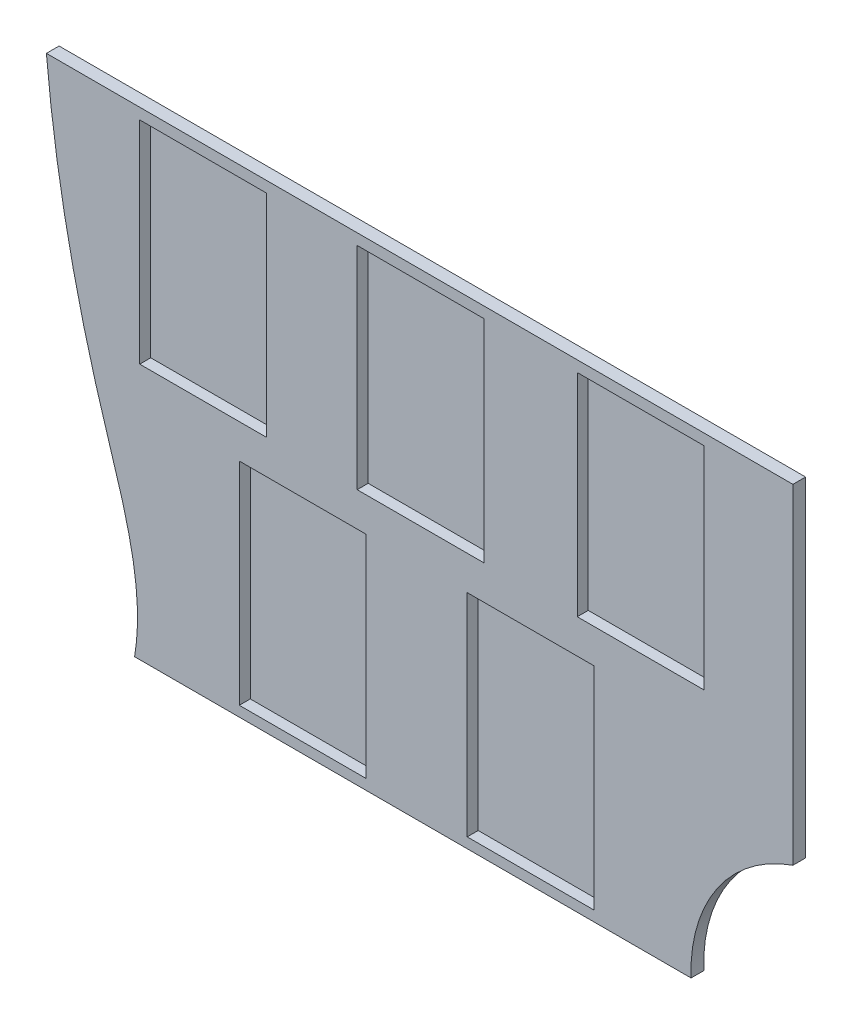
ISO-10303-21;
HEADER;
FILE_DESCRIPTION(('STEP AP214'),'2;1');
FILE_NAME('part.step','',(''),(''),'','','');
FILE_SCHEMA(('AUTOMOTIVE_DESIGN { 1 0 10303 214 1 1 1 1 }'));
ENDSEC;
DATA;
#1=APPLICATION_CONTEXT('core data for automotive mechanical design processes');
#2=APPLICATION_PROTOCOL_DEFINITION('international standard','automotive_design',2000,#1);
#3=PRODUCT_CONTEXT('',#1,'mechanical');
#4=PRODUCT('Part','Part','',(#3));
#5=PRODUCT_RELATED_PRODUCT_CATEGORY('part','',(#4));
#6=PRODUCT_DEFINITION_FORMATION('','',#4);
#7=PRODUCT_DEFINITION_CONTEXT('part definition',#1,'design');
#8=PRODUCT_DEFINITION('design','',#6,#7);
#9=PRODUCT_DEFINITION_SHAPE('','',#8);
#10=(LENGTH_UNIT() NAMED_UNIT(*) SI_UNIT(.MILLI.,.METRE.));
#11=(NAMED_UNIT(*) PLANE_ANGLE_UNIT() SI_UNIT($,.RADIAN.));
#12=(NAMED_UNIT(*) SI_UNIT($,.STERADIAN.) SOLID_ANGLE_UNIT());
#13=UNCERTAINTY_MEASURE_WITH_UNIT(LENGTH_MEASURE(1.E-05),#10,'distance_accuracy_value','');
#14=(GEOMETRIC_REPRESENTATION_CONTEXT(3) GLOBAL_UNCERTAINTY_ASSIGNED_CONTEXT((#13)) GLOBAL_UNIT_ASSIGNED_CONTEXT((#10,
#11,#12)) REPRESENTATION_CONTEXT('',''));
#15=CARTESIAN_POINT('',(0.,0.,0.));
#16=DIRECTION('',(0.,0.,1.));
#17=DIRECTION('',(1.,0.,0.));
#18=AXIS2_PLACEMENT_3D('',#15,#16,#17);
#19=CARTESIAN_POINT('',(-10.924558286228,76.07506,1.5));
#20=CARTESIAN_POINT('',(-11.3352160372191,65.7010516205482,1.5));
#21=CARTESIAN_POINT('',(-10.1348838021836,47.6104937241192,1.5));
#22=CARTESIAN_POINT('',(-4.20479563086311,22.5706008825194,1.5));
#23=CARTESIAN_POINT('',(1.32459293414909,7.94260350650526,1.5));
#24=CARTESIAN_POINT('',(0.,0.,1.5));
#25=B_SPLINE_CURVE_WITH_KNOTS('',3,(#19,#20,#21,#22,#23,#24),.UNSPECIFIED.,.F.,.F.,(4,1,1,4),
(0.,0.403327980613903,0.698479283031292,1.),.UNSPECIFIED.);
#26=DIRECTION('',(0.,0.,-1.));
#27=VECTOR('',#26,1.);
#28=SURFACE_OF_LINEAR_EXTRUSION('',#25,#27);
#29=CARTESIAN_POINT('',(-10.4260949755614,56.55,1.5));
#30=VERTEX_POINT('',#29);
#31=CARTESIAN_POINT('',(0.,0.,1.5));
#32=VERTEX_POINT('',#31);
#33=EDGE_CURVE('E376',#30,#32,#25,.T.);
#34=ORIENTED_EDGE('',*,*,#33,.F.);
#35=DIRECTION('',(0.,0.,-1.));
#36=VECTOR('',#35,1.);
#37=CARTESIAN_POINT('',(-10.4260949755614,56.55,1.5));
#38=LINE('',#37,#36);
#39=CARTESIAN_POINT('',(-10.4260949755614,56.55,0.));
#40=VERTEX_POINT('',#39);
#41=EDGE_CURVE('E370',#30,#40,#38,.T.);
#42=ORIENTED_EDGE('',*,*,#41,.T.);
#43=CARTESIAN_POINT('',(-10.924558286228,76.07506,0.));
#44=CARTESIAN_POINT('',(-11.3352160372191,65.7010516205482,0.));
#45=CARTESIAN_POINT('',(-10.1348838021836,47.6104937241192,0.));
#46=CARTESIAN_POINT('',(-4.20479563086311,22.5706008825194,0.));
#47=CARTESIAN_POINT('',(1.32459293414909,7.94260350650526,0.));
#48=CARTESIAN_POINT('',(0.,0.,0.));
#49=B_SPLINE_CURVE_WITH_KNOTS('',3,(#43,#44,#45,#46,#47,#48),.UNSPECIFIED.,.F.,.F.,(4,1,1,4),
(0.,0.403327980613903,0.698479283031292,1.),.UNSPECIFIED.);
#50=CARTESIAN_POINT('',(0.,0.,0.));
#51=VERTEX_POINT('',#50);
#52=EDGE_CURVE('E375',#40,#51,#49,.T.);
#53=ORIENTED_EDGE('',*,*,#52,.T.);
#54=DIRECTION('',(0.,0.,-1.));
#55=VECTOR('',#54,1.);
#56=CARTESIAN_POINT('',(0.,0.,1.5));
#57=LINE('',#56,#55);
#58=EDGE_CURVE('E43',#32,#51,#57,.T.);
#59=ORIENTED_EDGE('',*,*,#58,.F.);
#60=EDGE_LOOP('',(#34,#42,#53,#59));
#61=FACE_BOUND('',#60,.T.);
#62=ADVANCED_FACE('F35',(#61),#28,.F.);
#63=CARTESIAN_POINT('',(0.,0.,1.5));
#64=DIRECTION('',(0.,1.,0.));
#65=DIRECTION('',(0.,0.,1.));
#66=AXIS2_PLACEMENT_3D('',#63,#64,#65);
#67=PLANE('',#66);
#68=DIRECTION('',(1.,0.,0.));
#69=VECTOR('',#68,1.);
#70=CARTESIAN_POINT('',(0.,0.,0.));
#71=LINE('',#70,#69);
#72=CARTESIAN_POINT('',(65.76731,0.,0.));
#73=VERTEX_POINT('',#72);
#74=EDGE_CURVE('E396',#51,#73,#71,.T.);
#75=ORIENTED_EDGE('',*,*,#74,.T.);
#76=DIRECTION('',(0.,0.,-1.));
#77=VECTOR('',#76,1.);
#78=CARTESIAN_POINT('',(65.76731,0.,1.5));
#79=LINE('',#78,#77);
#80=CARTESIAN_POINT('',(65.76731,0.,1.5));
#81=VERTEX_POINT('',#80);
#82=EDGE_CURVE('E407',#81,#73,#79,.T.);
#83=ORIENTED_EDGE('',*,*,#82,.F.);
#84=DIRECTION('',(1.,0.,0.));
#85=VECTOR('',#84,1.);
#86=CARTESIAN_POINT('',(0.,0.,1.5));
#87=LINE('',#86,#85);
#88=EDGE_CURVE('E381',#32,#81,#87,.T.);
#89=ORIENTED_EDGE('',*,*,#88,.F.);
#90=ORIENTED_EDGE('',*,*,#58,.T.);
#91=EDGE_LOOP('',(#75,#83,#89,#90));
#92=FACE_BOUND('',#91,.T.);
#93=ADVANCED_FACE('F413',(#92),#67,.F.);
#94=CARTESIAN_POINT('',(83.6444405634415,0.646040445844383,1.5));
#95=DIRECTION('',(0.,0.,-1.));
#96=DIRECTION('',(-1.,0.,0.));
#97=AXIS2_PLACEMENT_3D('',#94,#95,#96);
#98=CYLINDRICAL_SURFACE('',#97,17.8888);
#99=CARTESIAN_POINT('',(83.6444405634415,0.646040445844383,0.));
#100=DIRECTION('',(0.,0.,-1.));
#101=DIRECTION('',(-1.,0.,0.));
#102=AXIS2_PLACEMENT_3D('',#99,#100,#101);
#103=CIRCLE('',#102,17.8888);
#104=CARTESIAN_POINT('',(77.804111713772,17.55461,0.));
#105=VERTEX_POINT('',#104);
#106=EDGE_CURVE('E401',#73,#105,#103,.T.);
#107=ORIENTED_EDGE('',*,*,#106,.T.);
#108=DIRECTION('',(0.,0.,-1.));
#109=VECTOR('',#108,1.);
#110=CARTESIAN_POINT('',(77.804111713772,17.55461,1.5));
#111=LINE('',#110,#109);
#112=CARTESIAN_POINT('',(77.804111713772,17.55461,1.5));
#113=VERTEX_POINT('',#112);
#114=EDGE_CURVE('E392',#113,#105,#111,.T.);
#115=ORIENTED_EDGE('',*,*,#114,.F.);
#116=CARTESIAN_POINT('',(83.6444405634415,0.646040445844383,1.5));
#117=DIRECTION('',(0.,0.,-1.));
#118=DIRECTION('',(-1.,0.,0.));
#119=AXIS2_PLACEMENT_3D('',#116,#117,#118);
#120=CIRCLE('',#119,17.8888);
#121=EDGE_CURVE('E387',#81,#113,#120,.T.);
#122=ORIENTED_EDGE('',*,*,#121,.F.);
#123=ORIENTED_EDGE('',*,*,#82,.T.);
#124=EDGE_LOOP('',(#107,#115,#122,#123));
#125=FACE_BOUND('',#124,.T.);
#126=ADVANCED_FACE('F426',(#125),#98,.F.);
#127=CARTESIAN_POINT('',(77.804111713772,17.55461,1.5));
#128=DIRECTION('',(-1.,0.,0.));
#129=DIRECTION('',(0.,-1.,0.));
#130=AXIS2_PLACEMENT_3D('',#127,#128,#129);
#131=PLANE('',#130);
#132=DIRECTION('',(0.,1.,0.));
#133=VECTOR('',#132,1.);
#134=CARTESIAN_POINT('',(77.804111713772,17.55461,0.));
#135=LINE('',#134,#133);
#136=CARTESIAN_POINT('',(77.804111713772,56.55,0.));
#137=VERTEX_POINT('',#136);
#138=EDGE_CURVE('E382',#105,#137,#135,.T.);
#139=ORIENTED_EDGE('',*,*,#138,.T.);
#140=DIRECTION('',(0.,0.,1.));
#141=VECTOR('',#140,1.);
#142=CARTESIAN_POINT('',(77.804111713772,56.55,1.5));
#143=LINE('',#142,#141);
#144=CARTESIAN_POINT('',(77.804111713772,56.55,1.5));
#145=VERTEX_POINT('',#144);
#146=EDGE_CURVE('E361',#137,#145,#143,.T.);
#147=ORIENTED_EDGE('',*,*,#146,.T.);
#148=DIRECTION('',(0.,1.,0.));
#149=VECTOR('',#148,1.);
#150=CARTESIAN_POINT('',(77.804111713772,17.55461,1.5));
#151=LINE('',#150,#149);
#152=EDGE_CURVE('E389',#113,#145,#151,.T.);
#153=ORIENTED_EDGE('',*,*,#152,.F.);
#154=ORIENTED_EDGE('',*,*,#114,.T.);
#155=EDGE_LOOP('',(#139,#147,#153,#154));
#156=FACE_BOUND('',#155,.T.);
#157=ADVANCED_FACE('F430',(#156),#131,.F.);
#158=CARTESIAN_POINT('',(-7.59671426617067,37.675096173794,1.5));
#159=DIRECTION('',(0.,0.,-1.));
#160=DIRECTION('',(-1.,0.,0.));
#161=AXIS2_PLACEMENT_3D('',#158,#159,#160);
#162=PLANE('',#161);
#163=DIRECTION('',(1.,0.,0.));
#164=VECTOR('',#163,1.);
#165=CARTESIAN_POINT('',(39.3104482923767,1.21758236796934,1.5));
#166=LINE('',#165,#164);
#167=CARTESIAN_POINT('',(39.3104482923767,1.21758236796934,1.5));
#168=VERTEX_POINT('',#167);
#169=CARTESIAN_POINT('',(54.3104482923767,1.21758236796934,1.5));
#170=VERTEX_POINT('',#169);
#171=EDGE_CURVE('E322',#168,#170,#166,.T.);
#172=ORIENTED_EDGE('',*,*,#171,.F.);
#173=DIRECTION('',(0.,-1.,0.));
#174=VECTOR('',#173,1.);
#175=CARTESIAN_POINT('',(39.3104482923767,26.2175823679693,1.5));
#176=LINE('',#175,#174);
#177=CARTESIAN_POINT('',(39.3104482923767,26.2175823679693,1.5));
#178=VERTEX_POINT('',#177);
#179=EDGE_CURVE('E50',#178,#168,#176,.T.);
#180=ORIENTED_EDGE('',*,*,#179,.F.);
#181=DIRECTION('',(-1.,0.,0.));
#182=VECTOR('',#181,1.);
#183=CARTESIAN_POINT('',(39.3104482923767,26.2175823679693,1.5));
#184=LINE('',#183,#182);
#185=CARTESIAN_POINT('',(54.3104482923767,26.2175823679693,1.5));
#186=VERTEX_POINT('',#185);
#187=EDGE_CURVE('E311',#186,#178,#184,.T.);
#188=ORIENTED_EDGE('',*,*,#187,.F.);
#189=DIRECTION('',(0.,1.,0.));
#190=VECTOR('',#189,1.);
#191=CARTESIAN_POINT('',(54.3104482923767,26.2175823679693,1.5));
#192=LINE('',#191,#190);
#193=EDGE_CURVE('E325',#170,#186,#192,.T.);
#194=ORIENTED_EDGE('',*,*,#193,.F.);
#195=EDGE_LOOP('',(#172,#180,#188,#194));
#196=FACE_BOUND('',#195,.T.);
#197=DIRECTION('',(1.,0.,0.));
#198=VECTOR('',#197,1.);
#199=CARTESIAN_POINT('',(12.3712803912311,1.21758236796934,1.5));
#200=LINE('',#199,#198);
#201=CARTESIAN_POINT('',(12.3712803912311,1.21758236796934,1.5));
#202=VERTEX_POINT('',#201);
#203=CARTESIAN_POINT('',(27.3712803912311,1.21758236796934,1.5));
#204=VERTEX_POINT('',#203);
#205=EDGE_CURVE('E292',#202,#204,#200,.T.);
#206=ORIENTED_EDGE('',*,*,#205,.F.);
#207=DIRECTION('',(0.,-1.,0.));
#208=VECTOR('',#207,1.);
#209=CARTESIAN_POINT('',(12.3712803912311,26.2175823679693,1.5));
#210=LINE('',#209,#208);
#211=CARTESIAN_POINT('',(12.3712803912311,26.2175823679693,1.5));
#212=VERTEX_POINT('',#211);
#213=EDGE_CURVE('E58',#212,#202,#210,.T.);
#214=ORIENTED_EDGE('',*,*,#213,.F.);
#215=DIRECTION('',(-1.,0.,0.));
#216=VECTOR('',#215,1.);
#217=CARTESIAN_POINT('',(12.3712803912311,26.2175823679693,1.5));
#218=LINE('',#217,#216);
#219=CARTESIAN_POINT('',(27.3712803912311,26.2175823679693,1.5));
#220=VERTEX_POINT('',#219);
#221=EDGE_CURVE('E281',#220,#212,#218,.T.);
#222=ORIENTED_EDGE('',*,*,#221,.F.);
#223=DIRECTION('',(0.,1.,0.));
#224=VECTOR('',#223,1.);
#225=CARTESIAN_POINT('',(27.3712803912311,26.2175823679693,1.5));
#226=LINE('',#225,#224);
#227=EDGE_CURVE('E296',#204,#220,#226,.T.);
#228=ORIENTED_EDGE('',*,*,#227,.F.);
#229=EDGE_LOOP('',(#206,#214,#222,#228));
#230=FACE_BOUND('',#229,.T.);
#231=DIRECTION('',(1.,0.,0.));
#232=VECTOR('',#231,1.);
#233=CARTESIAN_POINT('',(52.3155638308608,30.2507409742902,1.5));
#234=LINE('',#233,#232);
#235=CARTESIAN_POINT('',(52.3155638308608,30.2507409742902,1.5));
#236=VERTEX_POINT('',#235);
#237=CARTESIAN_POINT('',(67.3155638308608,30.2507409742902,1.5));
#238=VERTEX_POINT('',#237);
#239=EDGE_CURVE('E261',#236,#238,#234,.T.);
#240=ORIENTED_EDGE('',*,*,#239,.F.);
#241=DIRECTION('',(0.,-1.,0.));
#242=VECTOR('',#241,1.);
#243=CARTESIAN_POINT('',(52.3155638308608,55.2507409742902,1.5));
#244=LINE('',#243,#242);
#245=CARTESIAN_POINT('',(52.3155638308608,55.2507409742902,1.5));
#246=VERTEX_POINT('',#245);
#247=EDGE_CURVE('E259',#246,#236,#244,.T.);
#248=ORIENTED_EDGE('',*,*,#247,.F.);
#249=DIRECTION('',(-1.,0.,0.));
#250=VECTOR('',#249,1.);
#251=CARTESIAN_POINT('',(52.3155638308608,55.2507409742902,1.5));
#252=LINE('',#251,#250);
#253=CARTESIAN_POINT('',(67.3155638308608,55.2507409742902,1.5));
#254=VERTEX_POINT('',#253);
#255=EDGE_CURVE('E249',#254,#246,#252,.T.);
#256=ORIENTED_EDGE('',*,*,#255,.F.);
#257=DIRECTION('',(0.,1.,0.));
#258=VECTOR('',#257,1.);
#259=CARTESIAN_POINT('',(67.3155638308608,55.2507409742902,1.5));
#260=LINE('',#259,#258);
#261=EDGE_CURVE('E265',#238,#254,#260,.T.);
#262=ORIENTED_EDGE('',*,*,#261,.F.);
#263=EDGE_LOOP('',(#240,#248,#256,#262));
#264=FACE_BOUND('',#263,.T.);
#265=DIRECTION('',(1.,0.,0.));
#266=VECTOR('',#265,1.);
#267=CARTESIAN_POINT('',(26.3053327538926,30.2507409742902,1.5));
#268=LINE('',#267,#266);
#269=CARTESIAN_POINT('',(26.3053327538926,30.2507409742902,1.5));
#270=VERTEX_POINT('',#269);
#271=CARTESIAN_POINT('',(41.3053327538926,30.2507409742902,1.5));
#272=VERTEX_POINT('',#271);
#273=EDGE_CURVE('E234',#270,#272,#268,.T.);
#274=ORIENTED_EDGE('',*,*,#273,.F.);
#275=DIRECTION('',(0.,-1.,0.));
#276=VECTOR('',#275,1.);
#277=CARTESIAN_POINT('',(26.3053327538926,55.2507409742902,1.5));
#278=LINE('',#277,#276);
#279=CARTESIAN_POINT('',(26.3053327538926,55.2507409742902,1.5));
#280=VERTEX_POINT('',#279);
#281=EDGE_CURVE('E208',#280,#270,#278,.T.);
#282=ORIENTED_EDGE('',*,*,#281,.F.);
#283=DIRECTION('',(-1.,0.,0.));
#284=VECTOR('',#283,1.);
#285=CARTESIAN_POINT('',(26.3053327538926,55.2507409742902,1.5));
#286=LINE('',#285,#284);
#287=CARTESIAN_POINT('',(41.3053327538926,55.2507409742902,1.5));
#288=VERTEX_POINT('',#287);
#289=EDGE_CURVE('E225',#288,#280,#286,.T.);
#290=ORIENTED_EDGE('',*,*,#289,.F.);
#291=DIRECTION('',(0.,1.,0.));
#292=VECTOR('',#291,1.);
#293=CARTESIAN_POINT('',(41.3053327538926,55.2507409742902,1.5));
#294=LINE('',#293,#292);
#295=EDGE_CURVE('E228',#272,#288,#294,.T.);
#296=ORIENTED_EDGE('',*,*,#295,.F.);
#297=EDGE_LOOP('',(#274,#282,#290,#296));
#298=FACE_BOUND('',#297,.T.);
#299=DIRECTION('',(1.,0.,0.));
#300=VECTOR('',#299,1.);
#301=CARTESIAN_POINT('',(0.604747284983556,30.2507409742902,1.5));
#302=LINE('',#301,#300);
#303=CARTESIAN_POINT('',(0.604747284983557,30.2507409742902,1.5));
#304=VERTEX_POINT('',#303);
#305=CARTESIAN_POINT('',(15.6047472849836,30.2507409742902,1.5));
#306=VERTEX_POINT('',#305);
#307=EDGE_CURVE('E351',#304,#306,#302,.T.);
#308=ORIENTED_EDGE('',*,*,#307,.F.);
#309=DIRECTION('',(0.,-1.,0.));
#310=VECTOR('',#309,1.);
#311=CARTESIAN_POINT('',(0.604747284983553,55.2507409742902,1.5));
#312=LINE('',#311,#310);
#313=CARTESIAN_POINT('',(0.604747284983553,55.2507409742902,1.5));
#314=VERTEX_POINT('',#313);
#315=EDGE_CURVE('E241',#314,#304,#312,.T.);
#316=ORIENTED_EDGE('',*,*,#315,.F.);
#317=DIRECTION('',(-1.,0.,0.));
#318=VECTOR('',#317,1.);
#319=CARTESIAN_POINT('',(0.604747284983553,55.2507409742902,1.5));
#320=LINE('',#319,#318);
#321=CARTESIAN_POINT('',(15.6047472849836,55.2507409742902,1.5));
#322=VERTEX_POINT('',#321);
#323=EDGE_CURVE('E340',#322,#314,#320,.T.);
#324=ORIENTED_EDGE('',*,*,#323,.F.);
#325=DIRECTION('',(0.,1.,0.));
#326=VECTOR('',#325,1.);
#327=CARTESIAN_POINT('',(15.6047472849836,55.2507409742902,1.5));
#328=LINE('',#327,#326);
#329=EDGE_CURVE('E354',#306,#322,#328,.T.);
#330=ORIENTED_EDGE('',*,*,#329,.F.);
#331=EDGE_LOOP('',(#308,#316,#324,#330));
#332=FACE_BOUND('',#331,.T.);
#333=ORIENTED_EDGE('',*,*,#152,.T.);
#334=DIRECTION('',(-1.,0.,0.));
#335=VECTOR('',#334,1.);
#336=CARTESIAN_POINT('',(-7.59671426617067,56.55,1.5));
#337=LINE('',#336,#335);
#338=EDGE_CURVE('E373',#145,#30,#337,.T.);
#339=ORIENTED_EDGE('',*,*,#338,.T.);
#340=ORIENTED_EDGE('',*,*,#33,.T.);
#341=ORIENTED_EDGE('',*,*,#88,.T.);
#342=ORIENTED_EDGE('',*,*,#121,.T.);
#343=EDGE_LOOP('',(#333,#339,#340,#341,#342));
#344=FACE_BOUND('',#343,.T.);
#345=ADVANCED_FACE('F432',(#196,#230,#264,#298,#332,#344),#162,.F.);
#346=CARTESIAN_POINT('',(-7.59671426617067,37.675096173794,0.));
#347=DIRECTION('',(0.,0.,-1.));
#348=DIRECTION('',(-1.,0.,0.));
#349=AXIS2_PLACEMENT_3D('',#346,#347,#348);
#350=PLANE('',#349);
#351=DIRECTION('',(-1.,0.,0.));
#352=VECTOR('',#351,1.);
#353=CARTESIAN_POINT('',(-7.59671426617067,56.55,0.));
#354=LINE('',#353,#352);
#355=EDGE_CURVE('E11',#137,#40,#354,.T.);
#356=ORIENTED_EDGE('',*,*,#355,.F.);
#357=ORIENTED_EDGE('',*,*,#138,.F.);
#358=ORIENTED_EDGE('',*,*,#106,.F.);
#359=ORIENTED_EDGE('',*,*,#74,.F.);
#360=ORIENTED_EDGE('',*,*,#52,.F.);
#361=EDGE_LOOP('',(#356,#357,#358,#359,#360));
#362=FACE_BOUND('',#361,.T.);
#363=ADVANCED_FACE('F422',(#362),#350,.T.);
#364=CARTESIAN_POINT('',(-39.6440760778708,56.55,-54.));
#365=DIRECTION('',(0.,-1.,0.));
#366=DIRECTION('',(0.,0.,-1.));
#367=AXIS2_PLACEMENT_3D('',#364,#365,#366);
#368=PLANE('',#367);
#369=ORIENTED_EDGE('',*,*,#146,.F.);
#370=ORIENTED_EDGE('',*,*,#355,.T.);
#371=ORIENTED_EDGE('',*,*,#41,.F.);
#372=ORIENTED_EDGE('',*,*,#338,.F.);
#373=EDGE_LOOP('',(#369,#370,#371,#372));
#374=FACE_BOUND('',#373,.T.);
#375=ADVANCED_FACE('F434',(#374),#368,.F.);
#376=CARTESIAN_POINT('',(0.604747284983553,55.2507409742902,0.2));
#377=DIRECTION('',(-1.,0.,0.));
#378=DIRECTION('',(0.,-1.,0.));
#379=AXIS2_PLACEMENT_3D('',#376,#377,#378);
#380=PLANE('',#379);
#381=ORIENTED_EDGE('',*,*,#315,.T.);
#382=DIRECTION('',(0.,0.,1.));
#383=VECTOR('',#382,1.);
#384=CARTESIAN_POINT('',(0.604747284983556,30.2507409742902,0.2));
#385=LINE('',#384,#383);
#386=CARTESIAN_POINT('',(0.604747284983556,30.2507409742902,0.2));
#387=VERTEX_POINT('',#386);
#388=EDGE_CURVE('E349',#387,#304,#385,.T.);
#389=ORIENTED_EDGE('',*,*,#388,.F.);
#390=DIRECTION('',(0.,-1.,0.));
#391=VECTOR('',#390,1.);
#392=CARTESIAN_POINT('',(0.604747284983553,55.2507409742902,0.2));
#393=LINE('',#392,#391);
#394=CARTESIAN_POINT('',(0.604747284983553,55.2507409742902,0.2));
#395=VERTEX_POINT('',#394);
#396=EDGE_CURVE('E336',#395,#387,#393,.T.);
#397=ORIENTED_EDGE('',*,*,#396,.F.);
#398=DIRECTION('',(0.,0.,1.));
#399=VECTOR('',#398,1.);
#400=CARTESIAN_POINT('',(0.604747284983553,55.2507409742902,0.2));
#401=LINE('',#400,#399);
#402=EDGE_CURVE('E359',#395,#314,#401,.T.);
#403=ORIENTED_EDGE('',*,*,#402,.T.);
#404=EDGE_LOOP('',(#381,#389,#397,#403));
#405=FACE_BOUND('',#404,.T.);
#406=ADVANCED_FACE('F436',(#405),#380,.F.);
#407=CARTESIAN_POINT('',(0.604747284983553,55.2507409742902,0.2));
#408=DIRECTION('',(0.,1.,0.));
#409=DIRECTION('',(0.,0.,1.));
#410=AXIS2_PLACEMENT_3D('',#407,#408,#409);
#411=PLANE('',#410);
#412=ORIENTED_EDGE('',*,*,#323,.T.);
#413=ORIENTED_EDGE('',*,*,#402,.F.);
#414=DIRECTION('',(-1.,0.,0.));
#415=VECTOR('',#414,1.);
#416=CARTESIAN_POINT('',(0.604747284983553,55.2507409742902,0.2));
#417=LINE('',#416,#415);
#418=CARTESIAN_POINT('',(15.6047472849836,55.2507409742902,0.2));
#419=VERTEX_POINT('',#418);
#420=EDGE_CURVE('E346',#419,#395,#417,.T.);
#421=ORIENTED_EDGE('',*,*,#420,.F.);
#422=DIRECTION('',(0.,0.,1.));
#423=VECTOR('',#422,1.);
#424=CARTESIAN_POINT('',(15.6047472849836,55.2507409742902,0.2));
#425=LINE('',#424,#423);
#426=EDGE_CURVE('E362',#419,#322,#425,.T.);
#427=ORIENTED_EDGE('',*,*,#426,.T.);
#428=EDGE_LOOP('',(#412,#413,#421,#427));
#429=FACE_BOUND('',#428,.T.);
#430=ADVANCED_FACE('F442',(#429),#411,.F.);
#431=CARTESIAN_POINT('',(15.6047472849836,55.2507409742902,0.2));
#432=DIRECTION('',(1.,0.,0.));
#433=DIRECTION('',(0.,1.,0.));
#434=AXIS2_PLACEMENT_3D('',#431,#432,#433);
#435=PLANE('',#434);
#436=ORIENTED_EDGE('',*,*,#329,.T.);
#437=ORIENTED_EDGE('',*,*,#426,.F.);
#438=DIRECTION('',(0.,1.,0.));
#439=VECTOR('',#438,1.);
#440=CARTESIAN_POINT('',(15.6047472849836,55.2507409742902,0.2));
#441=LINE('',#440,#439);
#442=CARTESIAN_POINT('',(15.6047472849836,30.2507409742902,0.2));
#443=VERTEX_POINT('',#442);
#444=EDGE_CURVE('E343',#443,#419,#441,.T.);
#445=ORIENTED_EDGE('',*,*,#444,.F.);
#446=DIRECTION('',(0.,0.,1.));
#447=VECTOR('',#446,1.);
#448=CARTESIAN_POINT('',(15.6047472849836,30.2507409742902,0.2));
#449=LINE('',#448,#447);
#450=EDGE_CURVE('E364',#443,#306,#449,.T.);
#451=ORIENTED_EDGE('',*,*,#450,.T.);
#452=EDGE_LOOP('',(#436,#437,#445,#451));
#453=FACE_BOUND('',#452,.T.);
#454=ADVANCED_FACE('F485',(#453),#435,.F.);
#455=CARTESIAN_POINT('',(0.604747284983556,30.2507409742902,0.2));
#456=DIRECTION('',(0.,-1.,0.));
#457=DIRECTION('',(0.,0.,-1.));
#458=AXIS2_PLACEMENT_3D('',#455,#456,#457);
#459=PLANE('',#458);
#460=ORIENTED_EDGE('',*,*,#307,.T.);
#461=ORIENTED_EDGE('',*,*,#450,.F.);
#462=DIRECTION('',(1.,0.,0.));
#463=VECTOR('',#462,1.);
#464=CARTESIAN_POINT('',(0.604747284983556,30.2507409742902,0.2));
#465=LINE('',#464,#463);
#466=EDGE_CURVE('E339',#387,#443,#465,.T.);
#467=ORIENTED_EDGE('',*,*,#466,.F.);
#468=ORIENTED_EDGE('',*,*,#388,.T.);
#469=EDGE_LOOP('',(#460,#461,#467,#468));
#470=FACE_BOUND('',#469,.T.);
#471=ADVANCED_FACE('F478',(#470),#459,.F.);
#472=CARTESIAN_POINT('',(0.,0.,0.2));
#473=DIRECTION('',(0.,0.,1.));
#474=DIRECTION('',(1.,0.,0.));
#475=AXIS2_PLACEMENT_3D('',#472,#473,#474);
#476=PLANE('',#475);
#477=ORIENTED_EDGE('',*,*,#396,.T.);
#478=ORIENTED_EDGE('',*,*,#466,.T.);
#479=ORIENTED_EDGE('',*,*,#444,.T.);
#480=ORIENTED_EDGE('',*,*,#420,.T.);
#481=EDGE_LOOP('',(#477,#478,#479,#480));
#482=FACE_BOUND('',#481,.T.);
#483=ADVANCED_FACE('F487',(#482),#476,.T.);
#484=CARTESIAN_POINT('',(26.3053327538926,55.2507409742902,0.2));
#485=DIRECTION('',(-1.,0.,0.));
#486=DIRECTION('',(0.,-1.,0.));
#487=AXIS2_PLACEMENT_3D('',#484,#485,#486);
#488=PLANE('',#487);
#489=ORIENTED_EDGE('',*,*,#281,.T.);
#490=DIRECTION('',(0.,0.,1.));
#491=VECTOR('',#490,1.);
#492=CARTESIAN_POINT('',(26.3053327538926,30.2507409742902,0.2));
#493=LINE('',#492,#491);
#494=CARTESIAN_POINT('',(26.3053327538926,30.2507409742902,0.2));
#495=VERTEX_POINT('',#494);
#496=EDGE_CURVE('E201',#495,#270,#493,.T.);
#497=ORIENTED_EDGE('',*,*,#496,.F.);
#498=DIRECTION('',(0.,-1.,0.));
#499=VECTOR('',#498,1.);
#500=CARTESIAN_POINT('',(26.3053327538926,55.2507409742902,0.2));
#501=LINE('',#500,#499);
#502=CARTESIAN_POINT('',(26.3053327538926,55.2507409742902,0.2));
#503=VERTEX_POINT('',#502);
#504=EDGE_CURVE('E205',#503,#495,#501,.T.);
#505=ORIENTED_EDGE('',*,*,#504,.F.);
#506=DIRECTION('',(0.,0.,1.));
#507=VECTOR('',#506,1.);
#508=CARTESIAN_POINT('',(26.3053327538926,55.2507409742902,0.2));
#509=LINE('',#508,#507);
#510=EDGE_CURVE('E239',#503,#280,#509,.T.);
#511=ORIENTED_EDGE('',*,*,#510,.T.);
#512=EDGE_LOOP('',(#489,#497,#505,#511));
#513=FACE_BOUND('',#512,.T.);
#514=ADVANCED_FACE('F203',(#513),#488,.F.);
#515=CARTESIAN_POINT('',(26.3053327538926,55.2507409742902,0.2));
#516=DIRECTION('',(0.,1.,0.));
#517=DIRECTION('',(0.,0.,1.));
#518=AXIS2_PLACEMENT_3D('',#515,#516,#517);
#519=PLANE('',#518);
#520=ORIENTED_EDGE('',*,*,#289,.T.);
#521=ORIENTED_EDGE('',*,*,#510,.F.);
#522=DIRECTION('',(-1.,0.,0.));
#523=VECTOR('',#522,1.);
#524=CARTESIAN_POINT('',(26.3053327538926,55.2507409742902,0.2));
#525=LINE('',#524,#523);
#526=CARTESIAN_POINT('',(41.3053327538926,55.2507409742902,0.2));
#527=VERTEX_POINT('',#526);
#528=EDGE_CURVE('E213',#527,#503,#525,.T.);
#529=ORIENTED_EDGE('',*,*,#528,.F.);
#530=DIRECTION('',(0.,0.,1.));
#531=VECTOR('',#530,1.);
#532=CARTESIAN_POINT('',(41.3053327538926,55.2507409742902,0.2));
#533=LINE('',#532,#531);
#534=EDGE_CURVE('E242',#527,#288,#533,.T.);
#535=ORIENTED_EDGE('',*,*,#534,.T.);
#536=EDGE_LOOP('',(#520,#521,#529,#535));
#537=FACE_BOUND('',#536,.T.);
#538=ADVANCED_FACE('F494',(#537),#519,.F.);
#539=CARTESIAN_POINT('',(41.3053327538926,55.2507409742902,0.2));
#540=DIRECTION('',(1.,0.,0.));
#541=DIRECTION('',(0.,0.,-1.));
#542=AXIS2_PLACEMENT_3D('',#539,#540,#541);
#543=PLANE('',#542);
#544=ORIENTED_EDGE('',*,*,#295,.T.);
#545=ORIENTED_EDGE('',*,*,#534,.F.);
#546=DIRECTION('',(0.,1.,0.));
#547=VECTOR('',#546,1.);
#548=CARTESIAN_POINT('',(41.3053327538926,55.2507409742902,0.2));
#549=LINE('',#548,#547);
#550=CARTESIAN_POINT('',(41.3053327538926,30.2507409742902,0.2));
#551=VERTEX_POINT('',#550);
#552=EDGE_CURVE('E221',#551,#527,#549,.T.);
#553=ORIENTED_EDGE('',*,*,#552,.F.);
#554=DIRECTION('',(0.,0.,1.));
#555=VECTOR('',#554,1.);
#556=CARTESIAN_POINT('',(41.3053327538926,30.2507409742902,0.2));
#557=LINE('',#556,#555);
#558=EDGE_CURVE('E212',#551,#272,#557,.T.);
#559=ORIENTED_EDGE('',*,*,#558,.T.);
#560=EDGE_LOOP('',(#544,#545,#553,#559));
#561=FACE_BOUND('',#560,.T.);
#562=ADVANCED_FACE('F531',(#561),#543,.F.);
#563=CARTESIAN_POINT('',(26.3053327538926,30.2507409742902,0.2));
#564=DIRECTION('',(0.,-1.,0.));
#565=DIRECTION('',(0.,0.,-1.));
#566=AXIS2_PLACEMENT_3D('',#563,#564,#565);
#567=PLANE('',#566);
#568=ORIENTED_EDGE('',*,*,#273,.T.);
#569=ORIENTED_EDGE('',*,*,#558,.F.);
#570=DIRECTION('',(1.,0.,0.));
#571=VECTOR('',#570,1.);
#572=CARTESIAN_POINT('',(26.3053327538926,30.2507409742902,0.2));
#573=LINE('',#572,#571);
#574=EDGE_CURVE('E216',#495,#551,#573,.T.);
#575=ORIENTED_EDGE('',*,*,#574,.F.);
#576=ORIENTED_EDGE('',*,*,#496,.T.);
#577=EDGE_LOOP('',(#568,#569,#575,#576));
#578=FACE_BOUND('',#577,.T.);
#579=ADVANCED_FACE('F217',(#578),#567,.F.);
#580=CARTESIAN_POINT('',(0.,0.,0.2));
#581=DIRECTION('',(0.,0.,1.));
#582=DIRECTION('',(1.,0.,0.));
#583=AXIS2_PLACEMENT_3D('',#580,#581,#582);
#584=PLANE('',#583);
#585=ORIENTED_EDGE('',*,*,#504,.T.);
#586=ORIENTED_EDGE('',*,*,#574,.T.);
#587=ORIENTED_EDGE('',*,*,#552,.T.);
#588=ORIENTED_EDGE('',*,*,#528,.T.);
#589=EDGE_LOOP('',(#585,#586,#587,#588));
#590=FACE_BOUND('',#589,.T.);
#591=ADVANCED_FACE('F223',(#590),#584,.T.);
#592=CARTESIAN_POINT('',(52.3155638308608,55.2507409742902,0.2));
#593=DIRECTION('',(-1.,0.,0.));
#594=DIRECTION('',(0.,0.,1.));
#595=AXIS2_PLACEMENT_3D('',#592,#593,#594);
#596=PLANE('',#595);
#597=ORIENTED_EDGE('',*,*,#247,.T.);
#598=DIRECTION('',(0.,0.,1.));
#599=VECTOR('',#598,1.);
#600=CARTESIAN_POINT('',(52.3155638308608,30.2507409742902,0.2));
#601=LINE('',#600,#599);
#602=CARTESIAN_POINT('',(52.3155638308608,30.2507409742902,0.2));
#603=VERTEX_POINT('',#602);
#604=EDGE_CURVE('E258',#603,#236,#601,.T.);
#605=ORIENTED_EDGE('',*,*,#604,.F.);
#606=DIRECTION('',(0.,-1.,0.));
#607=VECTOR('',#606,1.);
#608=CARTESIAN_POINT('',(52.3155638308608,55.2507409742902,0.2));
#609=LINE('',#608,#607);
#610=CARTESIAN_POINT('',(52.3155638308608,55.2507409742902,0.2));
#611=VERTEX_POINT('',#610);
#612=EDGE_CURVE('E245',#611,#603,#609,.T.);
#613=ORIENTED_EDGE('',*,*,#612,.F.);
#614=DIRECTION('',(0.,0.,1.));
#615=VECTOR('',#614,1.);
#616=CARTESIAN_POINT('',(52.3155638308608,55.2507409742902,0.2));
#617=LINE('',#616,#615);
#618=EDGE_CURVE('E235',#611,#246,#617,.T.);
#619=ORIENTED_EDGE('',*,*,#618,.T.);
#620=EDGE_LOOP('',(#597,#605,#613,#619));
#621=FACE_BOUND('',#620,.T.);
#622=ADVANCED_FACE('F558',(#621),#596,.F.);
#623=CARTESIAN_POINT('',(52.3155638308608,55.2507409742902,0.2));
#624=DIRECTION('',(0.,1.,0.));
#625=DIRECTION('',(0.,0.,1.));
#626=AXIS2_PLACEMENT_3D('',#623,#624,#625);
#627=PLANE('',#626);
#628=ORIENTED_EDGE('',*,*,#255,.T.);
#629=ORIENTED_EDGE('',*,*,#618,.F.);
#630=DIRECTION('',(-1.,0.,0.));
#631=VECTOR('',#630,1.);
#632=CARTESIAN_POINT('',(52.3155638308608,55.2507409742902,0.2));
#633=LINE('',#632,#631);
#634=CARTESIAN_POINT('',(67.3155638308608,55.2507409742902,0.2));
#635=VERTEX_POINT('',#634);
#636=EDGE_CURVE('E255',#635,#611,#633,.T.);
#637=ORIENTED_EDGE('',*,*,#636,.F.);
#638=DIRECTION('',(0.,0.,1.));
#639=VECTOR('',#638,1.);
#640=CARTESIAN_POINT('',(67.3155638308608,55.2507409742902,0.2));
#641=LINE('',#640,#639);
#642=EDGE_CURVE('E271',#635,#254,#641,.T.);
#643=ORIENTED_EDGE('',*,*,#642,.T.);
#644=EDGE_LOOP('',(#628,#629,#637,#643));
#645=FACE_BOUND('',#644,.T.);
#646=ADVANCED_FACE('F567',(#645),#627,.F.);
#647=CARTESIAN_POINT('',(67.3155638308608,55.2507409742902,0.2));
#648=DIRECTION('',(1.,0.,0.));
#649=DIRECTION('',(0.,0.,-1.));
#650=AXIS2_PLACEMENT_3D('',#647,#648,#649);
#651=PLANE('',#650);
#652=ORIENTED_EDGE('',*,*,#261,.T.);
#653=ORIENTED_EDGE('',*,*,#642,.F.);
#654=DIRECTION('',(0.,1.,0.));
#655=VECTOR('',#654,1.);
#656=CARTESIAN_POINT('',(67.3155638308608,55.2507409742902,0.2));
#657=LINE('',#656,#655);
#658=CARTESIAN_POINT('',(67.3155638308608,30.2507409742902,0.2));
#659=VERTEX_POINT('',#658);
#660=EDGE_CURVE('E252',#659,#635,#657,.T.);
#661=ORIENTED_EDGE('',*,*,#660,.F.);
#662=DIRECTION('',(0.,0.,1.));
#663=VECTOR('',#662,1.);
#664=CARTESIAN_POINT('',(67.3155638308608,30.2507409742902,0.2));
#665=LINE('',#664,#663);
#666=EDGE_CURVE('E273',#659,#238,#665,.T.);
#667=ORIENTED_EDGE('',*,*,#666,.T.);
#668=EDGE_LOOP('',(#652,#653,#661,#667));
#669=FACE_BOUND('',#668,.T.);
#670=ADVANCED_FACE('F577',(#669),#651,.F.);
#671=CARTESIAN_POINT('',(52.3155638308608,30.2507409742902,0.2));
#672=DIRECTION('',(0.,-1.,0.));
#673=DIRECTION('',(0.,0.,-1.));
#674=AXIS2_PLACEMENT_3D('',#671,#672,#673);
#675=PLANE('',#674);
#676=ORIENTED_EDGE('',*,*,#239,.T.);
#677=ORIENTED_EDGE('',*,*,#666,.F.);
#678=DIRECTION('',(1.,0.,0.));
#679=VECTOR('',#678,1.);
#680=CARTESIAN_POINT('',(52.3155638308608,30.2507409742902,0.2));
#681=LINE('',#680,#679);
#682=EDGE_CURVE('E248',#603,#659,#681,.T.);
#683=ORIENTED_EDGE('',*,*,#682,.F.);
#684=ORIENTED_EDGE('',*,*,#604,.T.);
#685=EDGE_LOOP('',(#676,#677,#683,#684));
#686=FACE_BOUND('',#685,.T.);
#687=ADVANCED_FACE('F587',(#686),#675,.F.);
#688=CARTESIAN_POINT('',(0.,0.,0.2));
#689=DIRECTION('',(0.,0.,1.));
#690=DIRECTION('',(1.,0.,0.));
#691=AXIS2_PLACEMENT_3D('',#688,#689,#690);
#692=PLANE('',#691);
#693=ORIENTED_EDGE('',*,*,#612,.T.);
#694=ORIENTED_EDGE('',*,*,#682,.T.);
#695=ORIENTED_EDGE('',*,*,#660,.T.);
#696=ORIENTED_EDGE('',*,*,#636,.T.);
#697=EDGE_LOOP('',(#693,#694,#695,#696));
#698=FACE_BOUND('',#697,.T.);
#699=ADVANCED_FACE('F597',(#698),#692,.T.);
#700=CARTESIAN_POINT('',(12.3712803912311,26.2175823679693,0.2));
#701=DIRECTION('',(-1.,0.,0.));
#702=DIRECTION('',(0.,-1.,0.));
#703=AXIS2_PLACEMENT_3D('',#700,#701,#702);
#704=PLANE('',#703);
#705=ORIENTED_EDGE('',*,*,#213,.T.);
#706=DIRECTION('',(0.,0.,1.));
#707=VECTOR('',#706,1.);
#708=CARTESIAN_POINT('',(12.3712803912311,1.21758236796934,0.2));
#709=LINE('',#708,#707);
#710=CARTESIAN_POINT('',(12.3712803912311,1.21758236796934,0.2));
#711=VERTEX_POINT('',#710);
#712=EDGE_CURVE('E290',#711,#202,#709,.T.);
#713=ORIENTED_EDGE('',*,*,#712,.F.);
#714=DIRECTION('',(0.,-1.,0.));
#715=VECTOR('',#714,1.);
#716=CARTESIAN_POINT('',(12.3712803912311,26.2175823679693,0.2));
#717=LINE('',#716,#715);
#718=CARTESIAN_POINT('',(12.3712803912311,26.2175823679693,0.2));
#719=VERTEX_POINT('',#718);
#720=EDGE_CURVE('E277',#719,#711,#717,.T.);
#721=ORIENTED_EDGE('',*,*,#720,.F.);
#722=DIRECTION('',(0.,0.,1.));
#723=VECTOR('',#722,1.);
#724=CARTESIAN_POINT('',(12.3712803912311,26.2175823679693,0.2));
#725=LINE('',#724,#723);
#726=EDGE_CURVE('E262',#719,#212,#725,.T.);
#727=ORIENTED_EDGE('',*,*,#726,.T.);
#728=EDGE_LOOP('',(#705,#713,#721,#727));
#729=FACE_BOUND('',#728,.T.);
#730=ADVANCED_FACE('F607',(#729),#704,.F.);
#731=CARTESIAN_POINT('',(12.3712803912311,26.2175823679693,0.2));
#732=DIRECTION('',(0.,1.,0.));
#733=DIRECTION('',(0.,0.,1.));
#734=AXIS2_PLACEMENT_3D('',#731,#732,#733);
#735=PLANE('',#734);
#736=ORIENTED_EDGE('',*,*,#221,.T.);
#737=ORIENTED_EDGE('',*,*,#726,.F.);
#738=DIRECTION('',(-1.,0.,0.));
#739=VECTOR('',#738,1.);
#740=CARTESIAN_POINT('',(12.3712803912311,26.2175823679693,0.2));
#741=LINE('',#740,#739);
#742=CARTESIAN_POINT('',(27.3712803912311,26.2175823679693,0.2));
#743=VERTEX_POINT('',#742);
#744=EDGE_CURVE('E287',#743,#719,#741,.T.);
#745=ORIENTED_EDGE('',*,*,#744,.F.);
#746=DIRECTION('',(0.,0.,1.));
#747=VECTOR('',#746,1.);
#748=CARTESIAN_POINT('',(27.3712803912311,26.2175823679693,0.2));
#749=LINE('',#748,#747);
#750=EDGE_CURVE('E302',#743,#220,#749,.T.);
#751=ORIENTED_EDGE('',*,*,#750,.T.);
#752=EDGE_LOOP('',(#736,#737,#745,#751));
#753=FACE_BOUND('',#752,.T.);
#754=ADVANCED_FACE('F617',(#753),#735,.F.);
#755=CARTESIAN_POINT('',(27.3712803912311,26.2175823679693,0.2));
#756=DIRECTION('',(1.,0.,0.));
#757=DIRECTION('',(0.,0.,-1.));
#758=AXIS2_PLACEMENT_3D('',#755,#756,#757);
#759=PLANE('',#758);
#760=ORIENTED_EDGE('',*,*,#227,.T.);
#761=ORIENTED_EDGE('',*,*,#750,.F.);
#762=DIRECTION('',(0.,1.,0.));
#763=VECTOR('',#762,1.);
#764=CARTESIAN_POINT('',(27.3712803912311,26.2175823679693,0.2));
#765=LINE('',#764,#763);
#766=CARTESIAN_POINT('',(27.3712803912311,1.21758236796934,0.2));
#767=VERTEX_POINT('',#766);
#768=EDGE_CURVE('E284',#767,#743,#765,.T.);
#769=ORIENTED_EDGE('',*,*,#768,.F.);
#770=DIRECTION('',(0.,0.,1.));
#771=VECTOR('',#770,1.);
#772=CARTESIAN_POINT('',(27.3712803912311,1.21758236796934,0.2));
#773=LINE('',#772,#771);
#774=EDGE_CURVE('E304',#767,#204,#773,.T.);
#775=ORIENTED_EDGE('',*,*,#774,.T.);
#776=EDGE_LOOP('',(#760,#761,#769,#775));
#777=FACE_BOUND('',#776,.T.);
#778=ADVANCED_FACE('F626',(#777),#759,.F.);
#779=CARTESIAN_POINT('',(12.3712803912311,1.21758236796934,0.2));
#780=DIRECTION('',(0.,-1.,0.));
#781=DIRECTION('',(1.,0.,0.));
#782=AXIS2_PLACEMENT_3D('',#779,#780,#781);
#783=PLANE('',#782);
#784=ORIENTED_EDGE('',*,*,#205,.T.);
#785=ORIENTED_EDGE('',*,*,#774,.F.);
#786=DIRECTION('',(1.,0.,0.));
#787=VECTOR('',#786,1.);
#788=CARTESIAN_POINT('',(12.3712803912311,1.21758236796934,0.2));
#789=LINE('',#788,#787);
#790=EDGE_CURVE('E280',#711,#767,#789,.T.);
#791=ORIENTED_EDGE('',*,*,#790,.F.);
#792=ORIENTED_EDGE('',*,*,#712,.T.);
#793=EDGE_LOOP('',(#784,#785,#791,#792));
#794=FACE_BOUND('',#793,.T.);
#795=ADVANCED_FACE('F636',(#794),#783,.F.);
#796=CARTESIAN_POINT('',(0.,0.,0.2));
#797=DIRECTION('',(0.,0.,1.));
#798=DIRECTION('',(1.,0.,0.));
#799=AXIS2_PLACEMENT_3D('',#796,#797,#798);
#800=PLANE('',#799);
#801=ORIENTED_EDGE('',*,*,#720,.T.);
#802=ORIENTED_EDGE('',*,*,#790,.T.);
#803=ORIENTED_EDGE('',*,*,#768,.T.);
#804=ORIENTED_EDGE('',*,*,#744,.T.);
#805=EDGE_LOOP('',(#801,#802,#803,#804));
#806=FACE_BOUND('',#805,.T.);
#807=ADVANCED_FACE('F646',(#806),#800,.T.);
#808=CARTESIAN_POINT('',(39.3104482923767,26.2175823679693,0.2));
#809=DIRECTION('',(-1.,0.,0.));
#810=DIRECTION('',(0.,0.,1.));
#811=AXIS2_PLACEMENT_3D('',#808,#809,#810);
#812=PLANE('',#811);
#813=ORIENTED_EDGE('',*,*,#179,.T.);
#814=DIRECTION('',(0.,0.,1.));
#815=VECTOR('',#814,1.);
#816=CARTESIAN_POINT('',(39.3104482923767,1.21758236796934,0.2));
#817=LINE('',#816,#815);
#818=CARTESIAN_POINT('',(39.3104482923767,1.21758236796934,0.2));
#819=VERTEX_POINT('',#818);
#820=EDGE_CURVE('E320',#819,#168,#817,.T.);
#821=ORIENTED_EDGE('',*,*,#820,.F.);
#822=DIRECTION('',(0.,-1.,0.));
#823=VECTOR('',#822,1.);
#824=CARTESIAN_POINT('',(39.3104482923767,26.2175823679693,0.2));
#825=LINE('',#824,#823);
#826=CARTESIAN_POINT('',(39.3104482923767,26.2175823679693,0.2));
#827=VERTEX_POINT('',#826);
#828=EDGE_CURVE('E307',#827,#819,#825,.T.);
#829=ORIENTED_EDGE('',*,*,#828,.F.);
#830=DIRECTION('',(0.,0.,1.));
#831=VECTOR('',#830,1.);
#832=CARTESIAN_POINT('',(39.3104482923767,26.2175823679693,0.2));
#833=LINE('',#832,#831);
#834=EDGE_CURVE('E293',#827,#178,#833,.T.);
#835=ORIENTED_EDGE('',*,*,#834,.T.);
#836=EDGE_LOOP('',(#813,#821,#829,#835));
#837=FACE_BOUND('',#836,.T.);
#838=ADVANCED_FACE('F499',(#837),#812,.F.);
#839=CARTESIAN_POINT('',(39.3104482923767,26.2175823679693,0.2));
#840=DIRECTION('',(0.,1.,0.));
#841=DIRECTION('',(0.,0.,1.));
#842=AXIS2_PLACEMENT_3D('',#839,#840,#841);
#843=PLANE('',#842);
#844=ORIENTED_EDGE('',*,*,#187,.T.);
#845=ORIENTED_EDGE('',*,*,#834,.F.);
#846=DIRECTION('',(-1.,0.,0.));
#847=VECTOR('',#846,1.);
#848=CARTESIAN_POINT('',(39.3104482923767,26.2175823679693,0.2));
#849=LINE('',#848,#847);
#850=CARTESIAN_POINT('',(54.3104482923767,26.2175823679693,0.2));
#851=VERTEX_POINT('',#850);
#852=EDGE_CURVE('E317',#851,#827,#849,.T.);
#853=ORIENTED_EDGE('',*,*,#852,.F.);
#854=DIRECTION('',(0.,0.,1.));
#855=VECTOR('',#854,1.);
#856=CARTESIAN_POINT('',(54.3104482923767,26.2175823679693,0.2));
#857=LINE('',#856,#855);
#858=EDGE_CURVE('E331',#851,#186,#857,.T.);
#859=ORIENTED_EDGE('',*,*,#858,.T.);
#860=EDGE_LOOP('',(#844,#845,#853,#859));
#861=FACE_BOUND('',#860,.T.);
#862=ADVANCED_FACE('F665',(#861),#843,.F.);
#863=CARTESIAN_POINT('',(54.3104482923767,26.2175823679693,0.2));
#864=DIRECTION('',(1.,0.,0.));
#865=DIRECTION('',(0.,0.,-1.));
#866=AXIS2_PLACEMENT_3D('',#863,#864,#865);
#867=PLANE('',#866);
#868=ORIENTED_EDGE('',*,*,#193,.T.);
#869=ORIENTED_EDGE('',*,*,#858,.F.);
#870=DIRECTION('',(0.,1.,0.));
#871=VECTOR('',#870,1.);
#872=CARTESIAN_POINT('',(54.3104482923767,26.2175823679693,0.2));
#873=LINE('',#872,#871);
#874=CARTESIAN_POINT('',(54.3104482923767,1.21758236796934,0.2));
#875=VERTEX_POINT('',#874);
#876=EDGE_CURVE('E314',#875,#851,#873,.T.);
#877=ORIENTED_EDGE('',*,*,#876,.F.);
#878=DIRECTION('',(0.,0.,1.));
#879=VECTOR('',#878,1.);
#880=CARTESIAN_POINT('',(54.3104482923767,1.21758236796934,0.2));
#881=LINE('',#880,#879);
#882=EDGE_CURVE('E333',#875,#170,#881,.T.);
#883=ORIENTED_EDGE('',*,*,#882,.T.);
#884=EDGE_LOOP('',(#868,#869,#877,#883));
#885=FACE_BOUND('',#884,.T.);
#886=ADVANCED_FACE('F673',(#885),#867,.F.);
#887=CARTESIAN_POINT('',(39.3104482923767,1.21758236796934,0.2));
#888=DIRECTION('',(0.,-1.,0.));
#889=DIRECTION('',(1.,0.,0.));
#890=AXIS2_PLACEMENT_3D('',#887,#888,#889);
#891=PLANE('',#890);
#892=ORIENTED_EDGE('',*,*,#171,.T.);
#893=ORIENTED_EDGE('',*,*,#882,.F.);
#894=DIRECTION('',(1.,0.,0.));
#895=VECTOR('',#894,1.);
#896=CARTESIAN_POINT('',(39.3104482923767,1.21758236796934,0.2));
#897=LINE('',#896,#895);
#898=EDGE_CURVE('E310',#819,#875,#897,.T.);
#899=ORIENTED_EDGE('',*,*,#898,.F.);
#900=ORIENTED_EDGE('',*,*,#820,.T.);
#901=EDGE_LOOP('',(#892,#893,#899,#900));
#902=FACE_BOUND('',#901,.T.);
#903=ADVANCED_FACE('F683',(#902),#891,.F.);
#904=CARTESIAN_POINT('',(0.,0.,0.2));
#905=DIRECTION('',(0.,0.,1.));
#906=DIRECTION('',(1.,0.,0.));
#907=AXIS2_PLACEMENT_3D('',#904,#905,#906);
#908=PLANE('',#907);
#909=ORIENTED_EDGE('',*,*,#828,.T.);
#910=ORIENTED_EDGE('',*,*,#898,.T.);
#911=ORIENTED_EDGE('',*,*,#876,.T.);
#912=ORIENTED_EDGE('',*,*,#852,.T.);
#913=EDGE_LOOP('',(#909,#910,#911,#912));
#914=FACE_BOUND('',#913,.T.);
#915=ADVANCED_FACE('F693',(#914),#908,.T.);
#916=CLOSED_SHELL('',(#62,#93,#126,#157,#345,#363,#375,#406,#430,#454,#471,#483,#514,#538,#562,
#579,#591,#622,#646,#670,#687,#699,#730,#754,#778,#795,#807,#838,#862,#886,#903,#915));
#917=MANIFOLD_SOLID_BREP('B2',#916);
#918=ADVANCED_BREP_SHAPE_REPRESENTATION('',(#18,#917),#14);
#919=SHAPE_DEFINITION_REPRESENTATION(#9,#918);
ENDSEC;
END-ISO-10303-21;
